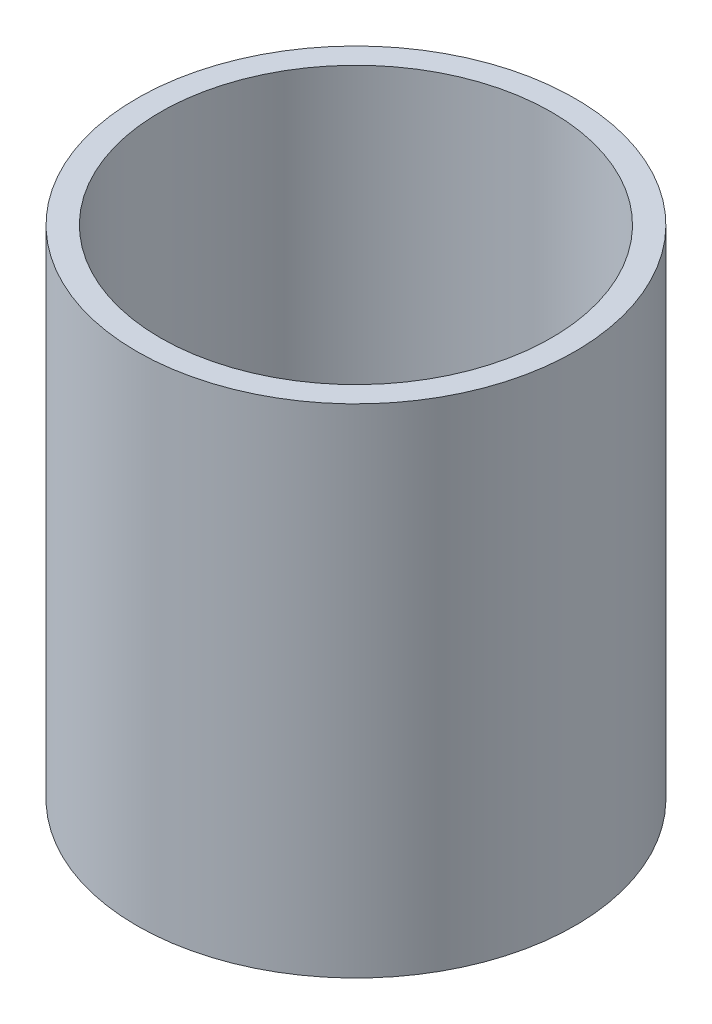
ISO-10303-21;
HEADER;
FILE_DESCRIPTION(('STEP AP214'),'2;1');
FILE_NAME('part.step','',(''),(''),'','','');
FILE_SCHEMA(('AUTOMOTIVE_DESIGN { 1 0 10303 214 1 1 1 1 }'));
ENDSEC;
DATA;
#1=APPLICATION_CONTEXT('core data for automotive mechanical design processes');
#2=APPLICATION_PROTOCOL_DEFINITION('international standard','automotive_design',2000,#1);
#3=PRODUCT_CONTEXT('',#1,'mechanical');
#4=PRODUCT('Part','Part','',(#3));
#5=PRODUCT_RELATED_PRODUCT_CATEGORY('part','',(#4));
#6=PRODUCT_DEFINITION_FORMATION('','',#4);
#7=PRODUCT_DEFINITION_CONTEXT('part definition',#1,'design');
#8=PRODUCT_DEFINITION('design','',#6,#7);
#9=PRODUCT_DEFINITION_SHAPE('','',#8);
#10=(LENGTH_UNIT() NAMED_UNIT(*) SI_UNIT(.MILLI.,.METRE.));
#11=(NAMED_UNIT(*) PLANE_ANGLE_UNIT() SI_UNIT($,.RADIAN.));
#12=(NAMED_UNIT(*) SI_UNIT($,.STERADIAN.) SOLID_ANGLE_UNIT());
#13=UNCERTAINTY_MEASURE_WITH_UNIT(LENGTH_MEASURE(1.E-05),#10,'distance_accuracy_value','');
#14=(GEOMETRIC_REPRESENTATION_CONTEXT(3) GLOBAL_UNCERTAINTY_ASSIGNED_CONTEXT((#13)) GLOBAL_UNIT_ASSIGNED_CONTEXT((#10,
#11,#12)) REPRESENTATION_CONTEXT('',''));
#15=CARTESIAN_POINT('',(0.,0.,0.));
#16=DIRECTION('',(0.,0.,1.));
#17=DIRECTION('',(1.,0.,0.));
#18=AXIS2_PLACEMENT_3D('',#15,#16,#17);
#19=CARTESIAN_POINT('',(0.,113.442398239091,0.));
#20=DIRECTION('',(0.,-1.,0.));
#21=DIRECTION('',(0.,0.,-1.));
#22=AXIS2_PLACEMENT_3D('',#19,#20,#21);
#23=CYLINDRICAL_SURFACE('',#22,50.);
#24=CARTESIAN_POINT('',(0.,113.442398239091,0.));
#25=DIRECTION('',(0.,1.,0.));
#26=DIRECTION('',(0.,0.,1.));
#27=AXIS2_PLACEMENT_3D('',#24,#25,#26);
#28=CIRCLE('',#27,50.);
#29=CARTESIAN_POINT('',(0.,113.442398239091,50.));
#30=VERTEX_POINT('',#29);
#31=EDGE_CURVE('E10',#30,#30,#28,.T.);
#32=ORIENTED_EDGE('',*,*,#31,.F.);
#33=EDGE_LOOP('',(#32));
#34=FACE_BOUND('',#33,.T.);
#35=CARTESIAN_POINT('',(0.,0.,0.));
#36=DIRECTION('',(0.,1.,0.));
#37=DIRECTION('',(0.,0.,1.));
#38=AXIS2_PLACEMENT_3D('',#35,#36,#37);
#39=CIRCLE('',#38,50.);
#40=CARTESIAN_POINT('',(0.,0.,50.));
#41=VERTEX_POINT('',#40);
#42=EDGE_CURVE('E37',#41,#41,#39,.T.);
#43=ORIENTED_EDGE('',*,*,#42,.T.);
#44=EDGE_LOOP('',(#43));
#45=FACE_BOUND('',#44,.T.);
#46=ADVANCED_FACE('F40',(#34,#45),#23,.T.);
#47=CARTESIAN_POINT('',(0.,113.442398239091,0.));
#48=DIRECTION('',(0.,1.,0.));
#49=DIRECTION('',(0.,0.,1.));
#50=AXIS2_PLACEMENT_3D('',#47,#48,#49);
#51=PLANE('',#50);
#52=CARTESIAN_POINT('',(0.,113.442398239091,0.));
#53=DIRECTION('',(0.,1.,0.));
#54=DIRECTION('',(0.,0.,1.));
#55=AXIS2_PLACEMENT_3D('',#52,#53,#54);
#56=CIRCLE('',#55,44.6193126592651);
#57=CARTESIAN_POINT('',(0.,113.442398239091,44.6193126592651));
#58=VERTEX_POINT('',#57);
#59=EDGE_CURVE('E50',#58,#58,#56,.T.);
#60=ORIENTED_EDGE('',*,*,#59,.F.);
#61=EDGE_LOOP('',(#60));
#62=FACE_BOUND('',#61,.T.);
#63=ORIENTED_EDGE('',*,*,#31,.T.);
#64=EDGE_LOOP('',(#63));
#65=FACE_BOUND('',#64,.T.);
#66=ADVANCED_FACE('F59',(#62,#65),#51,.T.);
#67=CARTESIAN_POINT('',(0.,0.,0.));
#68=DIRECTION('',(0.,1.,0.));
#69=DIRECTION('',(0.,0.,1.));
#70=AXIS2_PLACEMENT_3D('',#67,#68,#69);
#71=PLANE('',#70);
#72=CARTESIAN_POINT('',(0.,0.,0.));
#73=DIRECTION('',(0.,1.,0.));
#74=DIRECTION('',(0.,0.,1.));
#75=AXIS2_PLACEMENT_3D('',#72,#73,#74);
#76=CIRCLE('',#75,44.6193126592651);
#77=CARTESIAN_POINT('',(0.,0.,44.6193126592651));
#78=VERTEX_POINT('',#77);
#79=EDGE_CURVE('E47',#78,#78,#76,.T.);
#80=ORIENTED_EDGE('',*,*,#79,.T.);
#81=EDGE_LOOP('',(#80));
#82=FACE_BOUND('',#81,.T.);
#83=ORIENTED_EDGE('',*,*,#42,.F.);
#84=EDGE_LOOP('',(#83));
#85=FACE_BOUND('',#84,.T.);
#86=ADVANCED_FACE('F58',(#82,#85),#71,.F.);
#87=CARTESIAN_POINT('',(0.,113.442398239091,0.));
#88=DIRECTION('',(0.,-1.,0.));
#89=DIRECTION('',(0.,0.,-1.));
#90=AXIS2_PLACEMENT_3D('',#87,#88,#89);
#91=CYLINDRICAL_SURFACE('',#90,44.6193126592651);
#92=ORIENTED_EDGE('',*,*,#59,.T.);
#93=EDGE_LOOP('',(#92));
#94=FACE_BOUND('',#93,.T.);
#95=ORIENTED_EDGE('',*,*,#79,.F.);
#96=EDGE_LOOP('',(#95));
#97=FACE_BOUND('',#96,.T.);
#98=ADVANCED_FACE('F54',(#94,#97),#91,.F.);
#99=CLOSED_SHELL('',(#46,#66,#86,#98));
#100=MANIFOLD_SOLID_BREP('B2',#99);
#101=ADVANCED_BREP_SHAPE_REPRESENTATION('',(#18,#100),#14);
#102=SHAPE_DEFINITION_REPRESENTATION(#9,#101);
ENDSEC;
END-ISO-10303-21;
